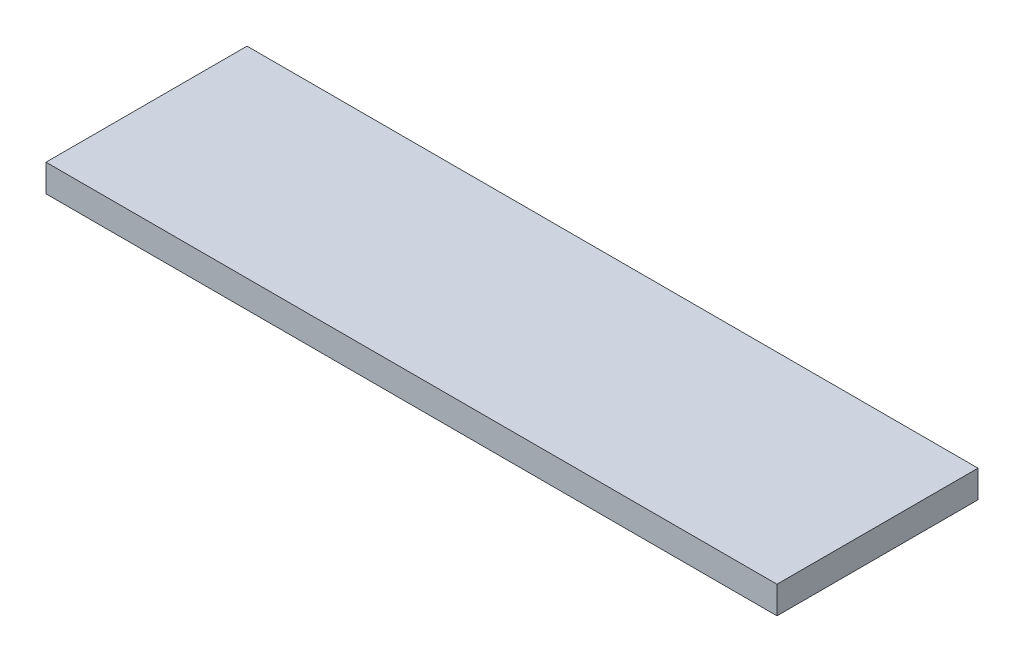
ISO-10303-21;
HEADER;
FILE_DESCRIPTION(('STEP AP214'),'2;1');
FILE_NAME('part.step','',(''),(''),'','','');
FILE_SCHEMA(('AUTOMOTIVE_DESIGN { 1 0 10303 214 1 1 1 1 }'));
ENDSEC;
DATA;
#1=APPLICATION_CONTEXT('core data for automotive mechanical design processes');
#2=APPLICATION_PROTOCOL_DEFINITION('international standard','automotive_design',2000,#1);
#3=PRODUCT_CONTEXT('',#1,'mechanical');
#4=PRODUCT('Part','Part','',(#3));
#5=PRODUCT_RELATED_PRODUCT_CATEGORY('part','',(#4));
#6=PRODUCT_DEFINITION_FORMATION('','',#4);
#7=PRODUCT_DEFINITION_CONTEXT('part definition',#1,'design');
#8=PRODUCT_DEFINITION('design','',#6,#7);
#9=PRODUCT_DEFINITION_SHAPE('','',#8);
#10=(LENGTH_UNIT() NAMED_UNIT(*) SI_UNIT(.MILLI.,.METRE.));
#11=(NAMED_UNIT(*) PLANE_ANGLE_UNIT() SI_UNIT($,.RADIAN.));
#12=(NAMED_UNIT(*) SI_UNIT($,.STERADIAN.) SOLID_ANGLE_UNIT());
#13=UNCERTAINTY_MEASURE_WITH_UNIT(LENGTH_MEASURE(1.E-05),#10,'distance_accuracy_value','');
#14=(GEOMETRIC_REPRESENTATION_CONTEXT(3) GLOBAL_UNCERTAINTY_ASSIGNED_CONTEXT((#13)) GLOBAL_UNIT_ASSIGNED_CONTEXT((#10,
#11,#12)) REPRESENTATION_CONTEXT('',''));
#15=CARTESIAN_POINT('',(0.,0.,0.));
#16=DIRECTION('',(0.,0.,1.));
#17=DIRECTION('',(1.,0.,0.));
#18=AXIS2_PLACEMENT_3D('',#15,#16,#17);
#19=CARTESIAN_POINT('',(508.,38.1,-139.7));
#20=DIRECTION('',(-1.,0.,0.));
#21=DIRECTION('',(0.,0.,1.));
#22=AXIS2_PLACEMENT_3D('',#19,#20,#21);
#23=PLANE('',#22);
#24=DIRECTION('',(0.,0.,-1.));
#25=VECTOR('',#24,1.);
#26=CARTESIAN_POINT('',(508.,0.,-139.7));
#27=LINE('',#26,#25);
#28=CARTESIAN_POINT('',(508.,0.,139.7));
#29=VERTEX_POINT('',#28);
#30=CARTESIAN_POINT('',(508.,0.,-139.7));
#31=VERTEX_POINT('',#30);
#32=EDGE_CURVE('E99',#29,#31,#27,.T.);
#33=ORIENTED_EDGE('',*,*,#32,.T.);
#34=DIRECTION('',(0.,-1.,0.));
#35=VECTOR('',#34,1.);
#36=CARTESIAN_POINT('',(508.,38.1,-139.7));
#37=LINE('',#36,#35);
#38=CARTESIAN_POINT('',(508.,38.1,-139.7));
#39=VERTEX_POINT('',#38);
#40=EDGE_CURVE('E11',#39,#31,#37,.T.);
#41=ORIENTED_EDGE('',*,*,#40,.F.);
#42=DIRECTION('',(0.,0.,-1.));
#43=VECTOR('',#42,1.);
#44=CARTESIAN_POINT('',(508.,38.1,-139.7));
#45=LINE('',#44,#43);
#46=CARTESIAN_POINT('',(508.,38.1,139.7));
#47=VERTEX_POINT('',#46);
#48=EDGE_CURVE('E87',#47,#39,#45,.T.);
#49=ORIENTED_EDGE('',*,*,#48,.F.);
#50=DIRECTION('',(0.,-1.,0.));
#51=VECTOR('',#50,1.);
#52=CARTESIAN_POINT('',(508.,38.1,139.7));
#53=LINE('',#52,#51);
#54=EDGE_CURVE('E95',#47,#29,#53,.T.);
#55=ORIENTED_EDGE('',*,*,#54,.T.);
#56=EDGE_LOOP('',(#33,#41,#49,#55));
#57=FACE_BOUND('',#56,.T.);
#58=ADVANCED_FACE('F36',(#57),#23,.F.);
#59=CARTESIAN_POINT('',(-508.,38.1,-139.7));
#60=DIRECTION('',(0.,0.,1.));
#61=DIRECTION('',(1.,0.,0.));
#62=AXIS2_PLACEMENT_3D('',#59,#60,#61);
#63=PLANE('',#62);
#64=DIRECTION('',(-1.,0.,0.));
#65=VECTOR('',#64,1.);
#66=CARTESIAN_POINT('',(-508.,0.,-139.7));
#67=LINE('',#66,#65);
#68=CARTESIAN_POINT('',(-508.,0.,-139.7));
#69=VERTEX_POINT('',#68);
#70=EDGE_CURVE('E91',#31,#69,#67,.T.);
#71=ORIENTED_EDGE('',*,*,#70,.T.);
#72=DIRECTION('',(0.,-1.,0.));
#73=VECTOR('',#72,1.);
#74=CARTESIAN_POINT('',(-508.,38.1,-139.7));
#75=LINE('',#74,#73);
#76=CARTESIAN_POINT('',(-508.,38.1,-139.7));
#77=VERTEX_POINT('',#76);
#78=EDGE_CURVE('E44',#77,#69,#75,.T.);
#79=ORIENTED_EDGE('',*,*,#78,.F.);
#80=DIRECTION('',(-1.,0.,0.));
#81=VECTOR('',#80,1.);
#82=CARTESIAN_POINT('',(-508.,38.1,-139.7));
#83=LINE('',#82,#81);
#84=EDGE_CURVE('E82',#39,#77,#83,.T.);
#85=ORIENTED_EDGE('',*,*,#84,.F.);
#86=ORIENTED_EDGE('',*,*,#40,.T.);
#87=EDGE_LOOP('',(#71,#79,#85,#86));
#88=FACE_BOUND('',#87,.T.);
#89=ADVANCED_FACE('F90',(#88),#63,.F.);
#90=CARTESIAN_POINT('',(-508.,38.1,-139.7));
#91=DIRECTION('',(1.,0.,0.));
#92=DIRECTION('',(0.,0.,-1.));
#93=AXIS2_PLACEMENT_3D('',#90,#91,#92);
#94=PLANE('',#93);
#95=DIRECTION('',(0.,0.,1.));
#96=VECTOR('',#95,1.);
#97=CARTESIAN_POINT('',(-508.,0.,-139.7));
#98=LINE('',#97,#96);
#99=CARTESIAN_POINT('',(-508.,0.,139.7));
#100=VERTEX_POINT('',#99);
#101=EDGE_CURVE('E69',#69,#100,#98,.T.);
#102=ORIENTED_EDGE('',*,*,#101,.T.);
#103=DIRECTION('',(0.,-1.,0.));
#104=VECTOR('',#103,1.);
#105=CARTESIAN_POINT('',(-508.,38.1,139.7));
#106=LINE('',#105,#104);
#107=CARTESIAN_POINT('',(-508.,38.1,139.7));
#108=VERTEX_POINT('',#107);
#109=EDGE_CURVE('E92',#108,#100,#106,.T.);
#110=ORIENTED_EDGE('',*,*,#109,.F.);
#111=DIRECTION('',(0.,0.,1.));
#112=VECTOR('',#111,1.);
#113=CARTESIAN_POINT('',(-508.,38.1,-139.7));
#114=LINE('',#113,#112);
#115=EDGE_CURVE('E85',#77,#108,#114,.T.);
#116=ORIENTED_EDGE('',*,*,#115,.F.);
#117=ORIENTED_EDGE('',*,*,#78,.T.);
#118=EDGE_LOOP('',(#102,#110,#116,#117));
#119=FACE_BOUND('',#118,.T.);
#120=ADVANCED_FACE('F93',(#119),#94,.F.);
#121=CARTESIAN_POINT('',(-508.,38.1,139.7));
#122=DIRECTION('',(0.,0.,-1.));
#123=DIRECTION('',(-1.,0.,0.));
#124=AXIS2_PLACEMENT_3D('',#121,#122,#123);
#125=PLANE('',#124);
#126=DIRECTION('',(1.,0.,0.));
#127=VECTOR('',#126,1.);
#128=CARTESIAN_POINT('',(-508.,0.,139.7));
#129=LINE('',#128,#127);
#130=EDGE_CURVE('E75',#100,#29,#129,.T.);
#131=ORIENTED_EDGE('',*,*,#130,.T.);
#132=ORIENTED_EDGE('',*,*,#54,.F.);
#133=DIRECTION('',(1.,0.,0.));
#134=VECTOR('',#133,1.);
#135=CARTESIAN_POINT('',(-508.,38.1,139.7));
#136=LINE('',#135,#134);
#137=EDGE_CURVE('E52',#108,#47,#136,.T.);
#138=ORIENTED_EDGE('',*,*,#137,.F.);
#139=ORIENTED_EDGE('',*,*,#109,.T.);
#140=EDGE_LOOP('',(#131,#132,#138,#139));
#141=FACE_BOUND('',#140,.T.);
#142=ADVANCED_FACE('F106',(#141),#125,.F.);
#143=CARTESIAN_POINT('',(0.,38.1,0.));
#144=DIRECTION('',(0.,1.,0.));
#145=DIRECTION('',(0.,0.,1.));
#146=AXIS2_PLACEMENT_3D('',#143,#144,#145);
#147=PLANE('',#146);
#148=ORIENTED_EDGE('',*,*,#48,.T.);
#149=ORIENTED_EDGE('',*,*,#84,.T.);
#150=ORIENTED_EDGE('',*,*,#115,.T.);
#151=ORIENTED_EDGE('',*,*,#137,.T.);
#152=EDGE_LOOP('',(#148,#149,#150,#151));
#153=FACE_BOUND('',#152,.T.);
#154=ADVANCED_FACE('F83',(#153),#147,.T.);
#155=CARTESIAN_POINT('',(0.,0.,0.));
#156=DIRECTION('',(0.,1.,0.));
#157=DIRECTION('',(0.,0.,1.));
#158=AXIS2_PLACEMENT_3D('',#155,#156,#157);
#159=PLANE('',#158);
#160=ORIENTED_EDGE('',*,*,#32,.F.);
#161=ORIENTED_EDGE('',*,*,#130,.F.);
#162=ORIENTED_EDGE('',*,*,#101,.F.);
#163=ORIENTED_EDGE('',*,*,#70,.F.);
#164=EDGE_LOOP('',(#160,#161,#162,#163));
#165=FACE_BOUND('',#164,.T.);
#166=ADVANCED_FACE('F109',(#165),#159,.F.);
#167=CLOSED_SHELL('',(#58,#89,#120,#142,#154,#166));
#168=MANIFOLD_SOLID_BREP('B2',#167);
#169=ADVANCED_BREP_SHAPE_REPRESENTATION('',(#18,#168),#14);
#170=SHAPE_DEFINITION_REPRESENTATION(#9,#169);
ENDSEC;
END-ISO-10303-21;
